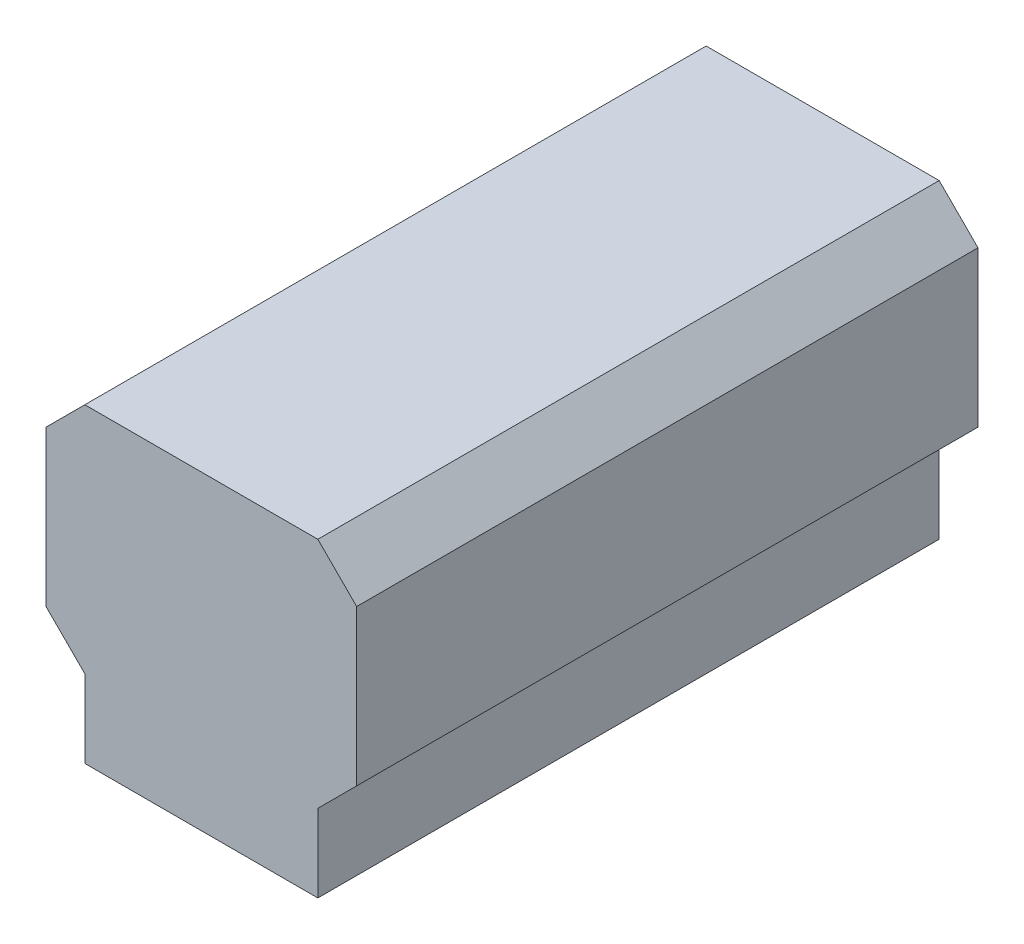
ISO-10303-21;
HEADER;
FILE_DESCRIPTION(('STEP AP214'),'2;1');
FILE_NAME('part.step','',(''),(''),'','','');
FILE_SCHEMA(('AUTOMOTIVE_DESIGN { 1 0 10303 214 1 1 1 1 }'));
ENDSEC;
DATA;
#1=APPLICATION_CONTEXT('core data for automotive mechanical design processes');
#2=APPLICATION_PROTOCOL_DEFINITION('international standard','automotive_design',2000,#1);
#3=PRODUCT_CONTEXT('',#1,'mechanical');
#4=PRODUCT('Part','Part','',(#3));
#5=PRODUCT_RELATED_PRODUCT_CATEGORY('part','',(#4));
#6=PRODUCT_DEFINITION_FORMATION('','',#4);
#7=PRODUCT_DEFINITION_CONTEXT('part definition',#1,'design');
#8=PRODUCT_DEFINITION('design','',#6,#7);
#9=PRODUCT_DEFINITION_SHAPE('','',#8);
#10=(LENGTH_UNIT() NAMED_UNIT(*) SI_UNIT(.MILLI.,.METRE.));
#11=(NAMED_UNIT(*) PLANE_ANGLE_UNIT() SI_UNIT($,.RADIAN.));
#12=(NAMED_UNIT(*) SI_UNIT($,.STERADIAN.) SOLID_ANGLE_UNIT());
#13=UNCERTAINTY_MEASURE_WITH_UNIT(LENGTH_MEASURE(1.E-05),#10,'distance_accuracy_value','');
#14=(GEOMETRIC_REPRESENTATION_CONTEXT(3) GLOBAL_UNCERTAINTY_ASSIGNED_CONTEXT((#13)) GLOBAL_UNIT_ASSIGNED_CONTEXT((#10,
#11,#12)) REPRESENTATION_CONTEXT('',''));
#15=CARTESIAN_POINT('',(0.,0.,0.));
#16=DIRECTION('',(0.,0.,1.));
#17=DIRECTION('',(1.,0.,0.));
#18=AXIS2_PLACEMENT_3D('',#15,#16,#17);
#19=CARTESIAN_POINT('',(-0.7499985,1.00000054,0.));
#20=DIRECTION('',(0.,1.,0.));
#21=DIRECTION('',(0.,0.,1.));
#22=AXIS2_PLACEMENT_3D('',#19,#20,#21);
#23=PLANE('',#22);
#24=DIRECTION('',(0.,0.,1.));
#25=VECTOR('',#24,1.);
#26=CARTESIAN_POINT('',(0.75000104,1.00000054,0.));
#27=LINE('',#26,#25);
#28=CARTESIAN_POINT('',(0.75000104,1.00000054,0.));
#29=VERTEX_POINT('',#28);
#30=CARTESIAN_POINT('',(0.75000104,1.00000054,3.99999962));
#31=VERTEX_POINT('',#30);
#32=EDGE_CURVE('E98',#29,#31,#27,.T.);
#33=ORIENTED_EDGE('',*,*,#32,.F.);
#34=DIRECTION('',(1.,0.,0.));
#35=VECTOR('',#34,1.);
#36=CARTESIAN_POINT('',(-0.7499985,1.00000054,0.));
#37=LINE('',#36,#35);
#38=CARTESIAN_POINT('',(-0.7499985,1.00000054,0.));
#39=VERTEX_POINT('',#38);
#40=EDGE_CURVE('E91',#29,#39,#37,.F.);
#41=ORIENTED_EDGE('',*,*,#40,.T.);
#42=DIRECTION('',(0.,0.,1.));
#43=VECTOR('',#42,1.);
#44=CARTESIAN_POINT('',(-0.7499985,1.00000054,0.));
#45=LINE('',#44,#43);
#46=CARTESIAN_POINT('',(-0.7499985,1.00000054,3.99999962));
#47=VERTEX_POINT('',#46);
#48=EDGE_CURVE('E101',#47,#39,#45,.F.);
#49=ORIENTED_EDGE('',*,*,#48,.F.);
#50=DIRECTION('',(1.,0.,0.));
#51=VECTOR('',#50,1.);
#52=CARTESIAN_POINT('',(-0.7499985,1.00000054,3.99999962));
#53=LINE('',#52,#51);
#54=EDGE_CURVE('E20',#47,#31,#53,.T.);
#55=ORIENTED_EDGE('',*,*,#54,.T.);
#56=EDGE_LOOP('',(#33,#41,#49,#55));
#57=FACE_BOUND('',#56,.T.);
#58=ADVANCED_FACE('F17',(#57),#23,.T.);
#59=CARTESIAN_POINT('',(0.75000104,1.00000054,0.));
#60=DIRECTION('',(0.707106781186548,0.707106781186548,0.));
#61=DIRECTION('',(-0.707106781186548,0.707106781186548,0.));
#62=AXIS2_PLACEMENT_3D('',#59,#60,#61);
#63=PLANE('',#62);
#64=DIRECTION('',(0.,0.,-1.));
#65=VECTOR('',#64,1.);
#66=CARTESIAN_POINT('',(1.00000054,0.75000104,0.));
#67=LINE('',#66,#65);
#68=CARTESIAN_POINT('',(1.00000054,0.75000104,0.));
#69=VERTEX_POINT('',#68);
#70=CARTESIAN_POINT('',(1.00000054,0.75000104,3.99999962));
#71=VERTEX_POINT('',#70);
#72=EDGE_CURVE('E123',#69,#71,#67,.F.);
#73=ORIENTED_EDGE('',*,*,#72,.F.);
#74=DIRECTION('',(-0.707106781186548,0.707106781186548,0.));
#75=VECTOR('',#74,1.);
#76=CARTESIAN_POINT('',(0.75000104,1.00000054,0.));
#77=LINE('',#76,#75);
#78=EDGE_CURVE('E112',#69,#29,#77,.T.);
#79=ORIENTED_EDGE('',*,*,#78,.T.);
#80=ORIENTED_EDGE('',*,*,#32,.T.);
#81=DIRECTION('',(-0.707106781186548,0.707106781186548,0.));
#82=VECTOR('',#81,1.);
#83=CARTESIAN_POINT('',(0.75000104,1.00000054,3.99999962));
#84=LINE('',#83,#82);
#85=EDGE_CURVE('E105',#31,#71,#84,.F.);
#86=ORIENTED_EDGE('',*,*,#85,.T.);
#87=EDGE_LOOP('',(#73,#79,#80,#86));
#88=FACE_BOUND('',#87,.T.);
#89=ADVANCED_FACE('F114',(#88),#63,.T.);
#90=CARTESIAN_POINT('',(-0.999998,0.75000104,0.));
#91=DIRECTION('',(-0.707106781186548,0.707106781186548,0.));
#92=DIRECTION('',(-0.707106781186548,-0.707106781186548,0.));
#93=AXIS2_PLACEMENT_3D('',#90,#91,#92);
#94=PLANE('',#93);
#95=ORIENTED_EDGE('',*,*,#48,.T.);
#96=DIRECTION('',(-0.707106781186548,-0.707106781186548,0.));
#97=VECTOR('',#96,1.);
#98=CARTESIAN_POINT('',(-0.999998,0.75000104,0.));
#99=LINE('',#98,#97);
#100=CARTESIAN_POINT('',(-0.999998,0.75000104,0.));
#101=VERTEX_POINT('',#100);
#102=EDGE_CURVE('E121',#39,#101,#99,.T.);
#103=ORIENTED_EDGE('',*,*,#102,.T.);
#104=DIRECTION('',(0.,0.,1.));
#105=VECTOR('',#104,1.);
#106=CARTESIAN_POINT('',(-0.999998,0.75000104,0.));
#107=LINE('',#106,#105);
#108=CARTESIAN_POINT('',(-0.999998,0.75000104,3.99999962));
#109=VERTEX_POINT('',#108);
#110=EDGE_CURVE('E132',#109,#101,#107,.F.);
#111=ORIENTED_EDGE('',*,*,#110,.F.);
#112=DIRECTION('',(-0.707106781186548,-0.707106781186548,0.));
#113=VECTOR('',#112,1.);
#114=CARTESIAN_POINT('',(-0.999998,0.75000104,3.99999962));
#115=LINE('',#114,#113);
#116=EDGE_CURVE('E118',#109,#47,#115,.F.);
#117=ORIENTED_EDGE('',*,*,#116,.T.);
#118=EDGE_LOOP('',(#95,#103,#111,#117));
#119=FACE_BOUND('',#118,.T.);
#120=ADVANCED_FACE('F197',(#119),#94,.T.);
#121=CARTESIAN_POINT('',(1.00000054,0.75000104,0.));
#122=DIRECTION('',(1.,0.,0.));
#123=DIRECTION('',(0.,0.,-1.));
#124=AXIS2_PLACEMENT_3D('',#121,#122,#123);
#125=PLANE('',#124);
#126=DIRECTION('',(0.,0.,1.));
#127=VECTOR('',#126,1.);
#128=CARTESIAN_POINT('',(1.00000054,-0.2499995,0.));
#129=LINE('',#128,#127);
#130=CARTESIAN_POINT('',(1.00000054,-0.2499995,0.));
#131=VERTEX_POINT('',#130);
#132=CARTESIAN_POINT('',(1.00000054,-0.2499995,3.99999962));
#133=VERTEX_POINT('',#132);
#134=EDGE_CURVE('E137',#131,#133,#129,.T.);
#135=ORIENTED_EDGE('',*,*,#134,.F.);
#136=DIRECTION('',(0.,1.,0.));
#137=VECTOR('',#136,1.);
#138=CARTESIAN_POINT('',(1.00000054,0.75000104,0.));
#139=LINE('',#138,#137);
#140=EDGE_CURVE('E126',#131,#69,#139,.T.);
#141=ORIENTED_EDGE('',*,*,#140,.T.);
#142=ORIENTED_EDGE('',*,*,#72,.T.);
#143=DIRECTION('',(0.,1.,0.));
#144=VECTOR('',#143,1.);
#145=CARTESIAN_POINT('',(1.00000054,0.75000104,3.99999962));
#146=LINE('',#145,#144);
#147=EDGE_CURVE('E108',#71,#133,#146,.F.);
#148=ORIENTED_EDGE('',*,*,#147,.T.);
#149=EDGE_LOOP('',(#135,#141,#142,#148));
#150=FACE_BOUND('',#149,.T.);
#151=ADVANCED_FACE('F194',(#150),#125,.T.);
#152=CARTESIAN_POINT('',(-0.999998,-0.2499995,0.));
#153=DIRECTION('',(-1.,0.,0.));
#154=DIRECTION('',(0.,0.,1.));
#155=AXIS2_PLACEMENT_3D('',#152,#153,#154);
#156=PLANE('',#155);
#157=ORIENTED_EDGE('',*,*,#110,.T.);
#158=DIRECTION('',(0.,1.,0.));
#159=VECTOR('',#158,1.);
#160=CARTESIAN_POINT('',(-0.999998,-0.2499995,0.));
#161=LINE('',#160,#159);
#162=CARTESIAN_POINT('',(-0.999998,-0.2499995,0.));
#163=VERTEX_POINT('',#162);
#164=EDGE_CURVE('E135',#101,#163,#161,.F.);
#165=ORIENTED_EDGE('',*,*,#164,.T.);
#166=DIRECTION('',(0.,0.,1.));
#167=VECTOR('',#166,1.);
#168=CARTESIAN_POINT('',(-0.999998,-0.2499995,0.));
#169=LINE('',#168,#167);
#170=CARTESIAN_POINT('',(-0.999998,-0.2499995,3.99999962));
#171=VERTEX_POINT('',#170);
#172=EDGE_CURVE('E145',#171,#163,#169,.F.);
#173=ORIENTED_EDGE('',*,*,#172,.F.);
#174=DIRECTION('',(0.,1.,0.));
#175=VECTOR('',#174,1.);
#176=CARTESIAN_POINT('',(-0.999998,-0.2499995,3.99999962));
#177=LINE('',#176,#175);
#178=EDGE_CURVE('E129',#171,#109,#177,.T.);
#179=ORIENTED_EDGE('',*,*,#178,.T.);
#180=EDGE_LOOP('',(#157,#165,#173,#179));
#181=FACE_BOUND('',#180,.T.);
#182=ADVANCED_FACE('F196',(#181),#156,.T.);
#183=CARTESIAN_POINT('',(1.00000054,-0.2499995,0.));
#184=DIRECTION('',(0.707106781186548,-0.707106781186548,0.));
#185=DIRECTION('',(0.707106781186548,0.707106781186548,0.));
#186=AXIS2_PLACEMENT_3D('',#183,#184,#185);
#187=PLANE('',#186);
#188=DIRECTION('',(0.,0.,-1.));
#189=VECTOR('',#188,1.);
#190=CARTESIAN_POINT('',(0.75000104,-0.499999,0.));
#191=LINE('',#190,#189);
#192=CARTESIAN_POINT('',(0.75000104,-0.499999,0.));
#193=VERTEX_POINT('',#192);
#194=CARTESIAN_POINT('',(0.75000104,-0.499999,3.99999962));
#195=VERTEX_POINT('',#194);
#196=EDGE_CURVE('E150',#193,#195,#191,.F.);
#197=ORIENTED_EDGE('',*,*,#196,.F.);
#198=DIRECTION('',(0.707106781186548,0.707106781186548,0.));
#199=VECTOR('',#198,1.);
#200=CARTESIAN_POINT('',(1.00000054,-0.2499995,0.));
#201=LINE('',#200,#199);
#202=EDGE_CURVE('E142',#193,#131,#201,.T.);
#203=ORIENTED_EDGE('',*,*,#202,.T.);
#204=ORIENTED_EDGE('',*,*,#134,.T.);
#205=DIRECTION('',(0.707106781186548,0.707106781186548,0.));
#206=VECTOR('',#205,1.);
#207=CARTESIAN_POINT('',(1.00000054,-0.2499995,3.99999962));
#208=LINE('',#207,#206);
#209=EDGE_CURVE('E140',#133,#195,#208,.F.);
#210=ORIENTED_EDGE('',*,*,#209,.T.);
#211=EDGE_LOOP('',(#197,#203,#204,#210));
#212=FACE_BOUND('',#211,.T.);
#213=ADVANCED_FACE('F192',(#212),#187,.T.);
#214=CARTESIAN_POINT('',(-0.7499985,-0.499999,0.));
#215=DIRECTION('',(-0.707106781186548,-0.707106781186548,0.));
#216=DIRECTION('',(0.707106781186548,-0.707106781186548,0.));
#217=AXIS2_PLACEMENT_3D('',#214,#215,#216);
#218=PLANE('',#217);
#219=ORIENTED_EDGE('',*,*,#172,.T.);
#220=DIRECTION('',(0.707106781186548,-0.707106781186548,0.));
#221=VECTOR('',#220,1.);
#222=CARTESIAN_POINT('',(-0.7499985,-0.499999,0.));
#223=LINE('',#222,#221);
#224=CARTESIAN_POINT('',(-0.7499985,-0.499999,0.));
#225=VERTEX_POINT('',#224);
#226=EDGE_CURVE('E148',#163,#225,#223,.T.);
#227=ORIENTED_EDGE('',*,*,#226,.T.);
#228=DIRECTION('',(0.,0.,1.));
#229=VECTOR('',#228,1.);
#230=CARTESIAN_POINT('',(-0.7499985,-0.499999,0.));
#231=LINE('',#230,#229);
#232=CARTESIAN_POINT('',(-0.7499985,-0.499999,3.99999962));
#233=VERTEX_POINT('',#232);
#234=EDGE_CURVE('E161',#233,#225,#231,.F.);
#235=ORIENTED_EDGE('',*,*,#234,.F.);
#236=DIRECTION('',(-0.707106781186547,0.707106781186548,0.));
#237=VECTOR('',#236,1.);
#238=CARTESIAN_POINT('',(-0.7499985,-0.499999,3.99999962));
#239=LINE('',#238,#237);
#240=EDGE_CURVE('E155',#233,#171,#239,.T.);
#241=ORIENTED_EDGE('',*,*,#240,.T.);
#242=EDGE_LOOP('',(#219,#227,#235,#241));
#243=FACE_BOUND('',#242,.T.);
#244=ADVANCED_FACE('F182',(#243),#218,.T.);
#245=CARTESIAN_POINT('',(0.75000104,-0.499999,0.));
#246=DIRECTION('',(1.,0.,0.));
#247=DIRECTION('',(0.,0.,-1.));
#248=AXIS2_PLACEMENT_3D('',#245,#246,#247);
#249=PLANE('',#248);
#250=DIRECTION('',(0.,0.,-1.));
#251=VECTOR('',#250,1.);
#252=CARTESIAN_POINT('',(0.75000104,-0.999998,0.));
#253=LINE('',#252,#251);
#254=CARTESIAN_POINT('',(0.75000104,-0.999998,0.));
#255=VERTEX_POINT('',#254);
#256=CARTESIAN_POINT('',(0.75000104,-0.999998,3.99999962));
#257=VERTEX_POINT('',#256);
#258=EDGE_CURVE('E167',#255,#257,#253,.F.);
#259=ORIENTED_EDGE('',*,*,#258,.F.);
#260=DIRECTION('',(0.,1.,0.));
#261=VECTOR('',#260,1.);
#262=CARTESIAN_POINT('',(0.75000104,-0.2499995,0.));
#263=LINE('',#262,#261);
#264=EDGE_CURVE('E163',#193,#255,#263,.F.);
#265=ORIENTED_EDGE('',*,*,#264,.F.);
#266=ORIENTED_EDGE('',*,*,#196,.T.);
#267=DIRECTION('',(0.,1.,0.));
#268=VECTOR('',#267,1.);
#269=CARTESIAN_POINT('',(0.75000104,-0.2499995,3.99999962));
#270=LINE('',#269,#268);
#271=EDGE_CURVE('E153',#195,#257,#270,.F.);
#272=ORIENTED_EDGE('',*,*,#271,.T.);
#273=EDGE_LOOP('',(#259,#265,#266,#272));
#274=FACE_BOUND('',#273,.T.);
#275=ADVANCED_FACE('F189',(#274),#249,.T.);
#276=CARTESIAN_POINT('',(1.00000054,-0.2499995,3.99999962));
#277=DIRECTION('',(0.,0.,-1.));
#278=DIRECTION('',(-1.,0.,0.));
#279=AXIS2_PLACEMENT_3D('',#276,#277,#278);
#280=PLANE('',#279);
#281=ORIENTED_EDGE('',*,*,#85,.F.);
#282=ORIENTED_EDGE('',*,*,#54,.F.);
#283=ORIENTED_EDGE('',*,*,#116,.F.);
#284=ORIENTED_EDGE('',*,*,#178,.F.);
#285=ORIENTED_EDGE('',*,*,#240,.F.);
#286=DIRECTION('',(0.,1.,0.));
#287=VECTOR('',#286,1.);
#288=CARTESIAN_POINT('',(-0.7499985,-0.999998,3.99999962));
#289=LINE('',#288,#287);
#290=CARTESIAN_POINT('',(-0.7499985,-0.999998,3.99999962));
#291=VERTEX_POINT('',#290);
#292=EDGE_CURVE('E158',#291,#233,#289,.T.);
#293=ORIENTED_EDGE('',*,*,#292,.F.);
#294=DIRECTION('',(1.,0.,0.));
#295=VECTOR('',#294,1.);
#296=CARTESIAN_POINT('',(0.75000104,-0.999998,3.99999962));
#297=LINE('',#296,#295);
#298=EDGE_CURVE('E170',#257,#291,#297,.F.);
#299=ORIENTED_EDGE('',*,*,#298,.F.);
#300=ORIENTED_EDGE('',*,*,#271,.F.);
#301=ORIENTED_EDGE('',*,*,#209,.F.);
#302=ORIENTED_EDGE('',*,*,#147,.F.);
#303=EDGE_LOOP('',(#281,#282,#283,#284,#285,#293,#299,#300,#301,#302));
#304=FACE_BOUND('',#303,.T.);
#305=ADVANCED_FACE('F106',(#304),#280,.F.);
#306=CARTESIAN_POINT('',(-0.7499985,-0.999998,0.));
#307=DIRECTION('',(-1.,0.,0.));
#308=DIRECTION('',(0.,0.,1.));
#309=AXIS2_PLACEMENT_3D('',#306,#307,#308);
#310=PLANE('',#309);
#311=ORIENTED_EDGE('',*,*,#234,.T.);
#312=DIRECTION('',(0.,1.,0.));
#313=VECTOR('',#312,1.);
#314=CARTESIAN_POINT('',(-0.7499985,-0.2499995,0.));
#315=LINE('',#314,#313);
#316=CARTESIAN_POINT('',(-0.7499985,-0.999998,0.));
#317=VERTEX_POINT('',#316);
#318=EDGE_CURVE('E35',#317,#225,#315,.T.);
#319=ORIENTED_EDGE('',*,*,#318,.F.);
#320=DIRECTION('',(0.,0.,-1.));
#321=VECTOR('',#320,1.);
#322=CARTESIAN_POINT('',(-0.7499985,-0.999998,0.));
#323=LINE('',#322,#321);
#324=EDGE_CURVE('E26',#291,#317,#323,.T.);
#325=ORIENTED_EDGE('',*,*,#324,.F.);
#326=ORIENTED_EDGE('',*,*,#292,.T.);
#327=EDGE_LOOP('',(#311,#319,#325,#326));
#328=FACE_BOUND('',#327,.T.);
#329=ADVANCED_FACE('F177',(#328),#310,.T.);
#330=CARTESIAN_POINT('',(1.00000054,-0.2499995,0.));
#331=DIRECTION('',(0.,0.,-1.));
#332=DIRECTION('',(-1.,0.,0.));
#333=AXIS2_PLACEMENT_3D('',#330,#331,#332);
#334=PLANE('',#333);
#335=ORIENTED_EDGE('',*,*,#78,.F.);
#336=ORIENTED_EDGE('',*,*,#140,.F.);
#337=ORIENTED_EDGE('',*,*,#202,.F.);
#338=ORIENTED_EDGE('',*,*,#264,.T.);
#339=DIRECTION('',(1.,0.,0.));
#340=VECTOR('',#339,1.);
#341=CARTESIAN_POINT('',(0.75000104,-0.999998,0.));
#342=LINE('',#341,#340);
#343=EDGE_CURVE('E11',#317,#255,#342,.T.);
#344=ORIENTED_EDGE('',*,*,#343,.F.);
#345=ORIENTED_EDGE('',*,*,#318,.T.);
#346=ORIENTED_EDGE('',*,*,#226,.F.);
#347=ORIENTED_EDGE('',*,*,#164,.F.);
#348=ORIENTED_EDGE('',*,*,#102,.F.);
#349=ORIENTED_EDGE('',*,*,#40,.F.);
#350=EDGE_LOOP('',(#335,#336,#337,#338,#344,#345,#346,#347,#348,#349));
#351=FACE_BOUND('',#350,.T.);
#352=ADVANCED_FACE('F185',(#351),#334,.T.);
#353=CARTESIAN_POINT('',(0.75000104,-0.999998,0.));
#354=DIRECTION('',(0.,-1.,0.));
#355=DIRECTION('',(0.,0.,-1.));
#356=AXIS2_PLACEMENT_3D('',#353,#354,#355);
#357=PLANE('',#356);
#358=ORIENTED_EDGE('',*,*,#324,.T.);
#359=ORIENTED_EDGE('',*,*,#343,.T.);
#360=ORIENTED_EDGE('',*,*,#258,.T.);
#361=ORIENTED_EDGE('',*,*,#298,.T.);
#362=EDGE_LOOP('',(#358,#359,#360,#361));
#363=FACE_BOUND('',#362,.T.);
#364=ADVANCED_FACE('F175',(#363),#357,.T.);
#365=CLOSED_SHELL('',(#58,#89,#120,#151,#182,#213,#244,#275,#305,#329,#352,#364));
#366=MANIFOLD_SOLID_BREP('B1',#365);
#367=ADVANCED_BREP_SHAPE_REPRESENTATION('',(#18,#366),#14);
#368=SHAPE_DEFINITION_REPRESENTATION(#9,#367);
ENDSEC;
END-ISO-10303-21;
